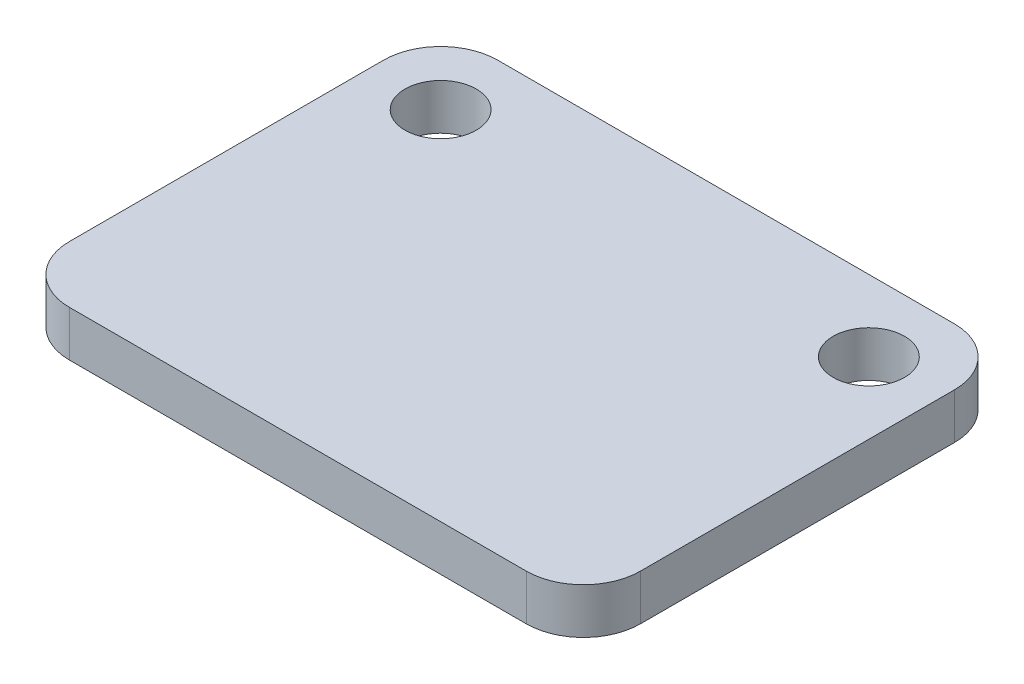
ISO-10303-21;
HEADER;
FILE_DESCRIPTION(('STEP AP214'),'2;1');
FILE_NAME('part.step','',(''),(''),'','','');
FILE_SCHEMA(('AUTOMOTIVE_DESIGN { 1 0 10303 214 1 1 1 1 }'));
ENDSEC;
DATA;
#1=APPLICATION_CONTEXT('core data for automotive mechanical design processes');
#2=APPLICATION_PROTOCOL_DEFINITION('international standard','automotive_design',2000,#1);
#3=PRODUCT_CONTEXT('',#1,'mechanical');
#4=PRODUCT('Part','Part','',(#3));
#5=PRODUCT_RELATED_PRODUCT_CATEGORY('part','',(#4));
#6=PRODUCT_DEFINITION_FORMATION('','',#4);
#7=PRODUCT_DEFINITION_CONTEXT('part definition',#1,'design');
#8=PRODUCT_DEFINITION('design','',#6,#7);
#9=PRODUCT_DEFINITION_SHAPE('','',#8);
#10=(LENGTH_UNIT() NAMED_UNIT(*) SI_UNIT(.MILLI.,.METRE.));
#11=(NAMED_UNIT(*) PLANE_ANGLE_UNIT() SI_UNIT($,.RADIAN.));
#12=(NAMED_UNIT(*) SI_UNIT($,.STERADIAN.) SOLID_ANGLE_UNIT());
#13=UNCERTAINTY_MEASURE_WITH_UNIT(LENGTH_MEASURE(1.E-05),#10,'distance_accuracy_value','');
#14=(GEOMETRIC_REPRESENTATION_CONTEXT(3) GLOBAL_UNCERTAINTY_ASSIGNED_CONTEXT((#13)) GLOBAL_UNIT_ASSIGNED_CONTEXT((#10,
#11,#12)) REPRESENTATION_CONTEXT('',''));
#15=CARTESIAN_POINT('',(0.,0.,0.));
#16=DIRECTION('',(0.,0.,1.));
#17=DIRECTION('',(1.,0.,0.));
#18=AXIS2_PLACEMENT_3D('',#15,#16,#17);
#19=CARTESIAN_POINT('',(0.,1.6,0.));
#20=DIRECTION('',(0.,1.,0.));
#21=DIRECTION('',(0.,0.,1.));
#22=AXIS2_PLACEMENT_3D('',#19,#20,#21);
#23=PLANE('',#22);
#24=CARTESIAN_POINT('',(-7.5,1.6,-5.));
#25=DIRECTION('',(0.,1.,0.));
#26=DIRECTION('',(0.,0.,1.));
#27=AXIS2_PLACEMENT_3D('',#24,#25,#26);
#28=CIRCLE('',#27,1.25);
#29=CARTESIAN_POINT('',(-7.5,1.6,-3.75));
#30=VERTEX_POINT('',#29);
#31=EDGE_CURVE('E208',#30,#30,#28,.T.);
#32=ORIENTED_EDGE('',*,*,#31,.F.);
#33=EDGE_LOOP('',(#32));
#34=FACE_BOUND('',#33,.T.);
#35=DIRECTION('',(-1.,0.,0.));
#36=VECTOR('',#35,1.);
#37=CARTESIAN_POINT('',(-10.,1.6,-7.5));
#38=LINE('',#37,#36);
#39=CARTESIAN_POINT('',(8.,1.6,-7.5));
#40=VERTEX_POINT('',#39);
#41=CARTESIAN_POINT('',(-8.,1.6,-7.5));
#42=VERTEX_POINT('',#41);
#43=EDGE_CURVE('E195',#40,#42,#38,.T.);
#44=ORIENTED_EDGE('',*,*,#43,.T.);
#45=CARTESIAN_POINT('',(-8.,1.6,-5.5));
#46=DIRECTION('',(0.,1.,0.));
#47=DIRECTION('',(0.,0.,1.));
#48=AXIS2_PLACEMENT_3D('',#45,#46,#47);
#49=CIRCLE('',#48,2.);
#50=CARTESIAN_POINT('',(-10.,1.6,-5.5));
#51=VERTEX_POINT('',#50);
#52=EDGE_CURVE('E168',#42,#51,#49,.T.);
#53=ORIENTED_EDGE('',*,*,#52,.T.);
#54=DIRECTION('',(0.,0.,1.));
#55=VECTOR('',#54,1.);
#56=CARTESIAN_POINT('',(-10.,1.6,-7.5));
#57=LINE('',#56,#55);
#58=CARTESIAN_POINT('',(-10.,1.6,5.5));
#59=VERTEX_POINT('',#58);
#60=EDGE_CURVE('E125',#51,#59,#57,.T.);
#61=ORIENTED_EDGE('',*,*,#60,.T.);
#62=CARTESIAN_POINT('',(-8.,1.6,5.5));
#63=DIRECTION('',(0.,1.,0.));
#64=DIRECTION('',(0.,0.,1.));
#65=AXIS2_PLACEMENT_3D('',#62,#63,#64);
#66=CIRCLE('',#65,2.);
#67=CARTESIAN_POINT('',(-8.,1.6,7.5));
#68=VERTEX_POINT('',#67);
#69=EDGE_CURVE('E60',#59,#68,#66,.T.);
#70=ORIENTED_EDGE('',*,*,#69,.T.);
#71=DIRECTION('',(1.,0.,0.));
#72=VECTOR('',#71,1.);
#73=CARTESIAN_POINT('',(-10.,1.6,7.5));
#74=LINE('',#73,#72);
#75=CARTESIAN_POINT('',(8.,1.6,7.5));
#76=VERTEX_POINT('',#75);
#77=EDGE_CURVE('E146',#68,#76,#74,.T.);
#78=ORIENTED_EDGE('',*,*,#77,.T.);
#79=CARTESIAN_POINT('',(8.,1.6,5.5));
#80=DIRECTION('',(0.,1.,0.));
#81=DIRECTION('',(0.,0.,1.));
#82=AXIS2_PLACEMENT_3D('',#79,#80,#81);
#83=CIRCLE('',#82,2.);
#84=CARTESIAN_POINT('',(10.,1.6,5.5));
#85=VERTEX_POINT('',#84);
#86=EDGE_CURVE('E162',#76,#85,#83,.T.);
#87=ORIENTED_EDGE('',*,*,#86,.T.);
#88=DIRECTION('',(0.,0.,-1.));
#89=VECTOR('',#88,1.);
#90=CARTESIAN_POINT('',(10.,1.6,-7.5));
#91=LINE('',#90,#89);
#92=CARTESIAN_POINT('',(10.,1.6,-5.5));
#93=VERTEX_POINT('',#92);
#94=EDGE_CURVE('E139',#85,#93,#91,.T.);
#95=ORIENTED_EDGE('',*,*,#94,.T.);
#96=CARTESIAN_POINT('',(8.,1.6,-5.5));
#97=DIRECTION('',(0.,1.,0.));
#98=DIRECTION('',(0.,0.,1.));
#99=AXIS2_PLACEMENT_3D('',#96,#97,#98);
#100=CIRCLE('',#99,2.);
#101=EDGE_CURVE('E165',#93,#40,#100,.T.);
#102=ORIENTED_EDGE('',*,*,#101,.T.);
#103=EDGE_LOOP('',(#44,#53,#61,#70,#78,#87,#95,#102));
#104=FACE_BOUND('',#103,.T.);
#105=CARTESIAN_POINT('',(7.5,1.6,-5.));
#106=DIRECTION('',(0.,1.,0.));
#107=DIRECTION('',(0.,0.,1.));
#108=AXIS2_PLACEMENT_3D('',#105,#106,#107);
#109=CIRCLE('',#108,1.25);
#110=CARTESIAN_POINT('',(7.5,1.6,-3.75));
#111=VERTEX_POINT('',#110);
#112=EDGE_CURVE('E215',#111,#111,#109,.T.);
#113=ORIENTED_EDGE('',*,*,#112,.F.);
#114=EDGE_LOOP('',(#113));
#115=FACE_BOUND('',#114,.T.);
#116=ADVANCED_FACE('F39',(#34,#104,#115),#23,.T.);
#117=CARTESIAN_POINT('',(0.,0.,0.));
#118=DIRECTION('',(0.,1.,0.));
#119=DIRECTION('',(0.,0.,1.));
#120=AXIS2_PLACEMENT_3D('',#117,#118,#119);
#121=PLANE('',#120);
#122=DIRECTION('',(0.,0.,1.));
#123=VECTOR('',#122,1.);
#124=CARTESIAN_POINT('',(-10.,0.,-7.5));
#125=LINE('',#124,#123);
#126=CARTESIAN_POINT('',(-10.,0.,-5.5));
#127=VERTEX_POINT('',#126);
#128=CARTESIAN_POINT('',(-10.,0.,5.5));
#129=VERTEX_POINT('',#128);
#130=EDGE_CURVE('E123',#127,#129,#125,.T.);
#131=ORIENTED_EDGE('',*,*,#130,.F.);
#132=CARTESIAN_POINT('',(-8.,0.,-5.5));
#133=DIRECTION('',(0.,1.,0.));
#134=DIRECTION('',(0.,0.,1.));
#135=AXIS2_PLACEMENT_3D('',#132,#133,#134);
#136=CIRCLE('',#135,2.);
#137=CARTESIAN_POINT('',(-8.,0.,-7.5));
#138=VERTEX_POINT('',#137);
#139=EDGE_CURVE('E105',#127,#138,#136,.F.);
#140=ORIENTED_EDGE('',*,*,#139,.T.);
#141=DIRECTION('',(-1.,0.,0.));
#142=VECTOR('',#141,1.);
#143=CARTESIAN_POINT('',(-10.,0.,-7.5));
#144=LINE('',#143,#142);
#145=CARTESIAN_POINT('',(8.,0.,-7.5));
#146=VERTEX_POINT('',#145);
#147=EDGE_CURVE('E135',#146,#138,#144,.T.);
#148=ORIENTED_EDGE('',*,*,#147,.F.);
#149=CARTESIAN_POINT('',(8.,0.,-5.5));
#150=DIRECTION('',(0.,1.,0.));
#151=DIRECTION('',(0.,0.,1.));
#152=AXIS2_PLACEMENT_3D('',#149,#150,#151);
#153=CIRCLE('',#152,2.);
#154=CARTESIAN_POINT('',(10.,0.,-5.5));
#155=VERTEX_POINT('',#154);
#156=EDGE_CURVE('E117',#146,#155,#153,.F.);
#157=ORIENTED_EDGE('',*,*,#156,.T.);
#158=DIRECTION('',(0.,0.,-1.));
#159=VECTOR('',#158,1.);
#160=CARTESIAN_POINT('',(10.,0.,-7.5));
#161=LINE('',#160,#159);
#162=CARTESIAN_POINT('',(10.,0.,5.5));
#163=VERTEX_POINT('',#162);
#164=EDGE_CURVE('E141',#163,#155,#161,.T.);
#165=ORIENTED_EDGE('',*,*,#164,.F.);
#166=CARTESIAN_POINT('',(8.,0.,5.5));
#167=DIRECTION('',(0.,1.,0.));
#168=DIRECTION('',(0.,0.,1.));
#169=AXIS2_PLACEMENT_3D('',#166,#167,#168);
#170=CIRCLE('',#169,2.);
#171=CARTESIAN_POINT('',(8.,0.,7.5));
#172=VERTEX_POINT('',#171);
#173=EDGE_CURVE('E150',#163,#172,#170,.F.);
#174=ORIENTED_EDGE('',*,*,#173,.T.);
#175=DIRECTION('',(1.,0.,0.));
#176=VECTOR('',#175,1.);
#177=CARTESIAN_POINT('',(-10.,0.,7.5));
#178=LINE('',#177,#176);
#179=CARTESIAN_POINT('',(-8.,0.,7.5));
#180=VERTEX_POINT('',#179);
#181=EDGE_CURVE('E134',#180,#172,#178,.T.);
#182=ORIENTED_EDGE('',*,*,#181,.F.);
#183=CARTESIAN_POINT('',(-8.,0.,5.5));
#184=DIRECTION('',(0.,1.,0.));
#185=DIRECTION('',(0.,0.,1.));
#186=AXIS2_PLACEMENT_3D('',#183,#184,#185);
#187=CIRCLE('',#186,2.);
#188=EDGE_CURVE('E127',#180,#129,#187,.F.);
#189=ORIENTED_EDGE('',*,*,#188,.T.);
#190=EDGE_LOOP('',(#131,#140,#148,#157,#165,#174,#182,#189));
#191=FACE_BOUND('',#190,.T.);
#192=CARTESIAN_POINT('',(-7.5,0.,-5.));
#193=DIRECTION('',(0.,1.,0.));
#194=DIRECTION('',(0.,0.,1.));
#195=AXIS2_PLACEMENT_3D('',#192,#193,#194);
#196=CIRCLE('',#195,1.25);
#197=CARTESIAN_POINT('',(-7.5,0.,-3.75));
#198=VERTEX_POINT('',#197);
#199=EDGE_CURVE('E201',#198,#198,#196,.T.);
#200=ORIENTED_EDGE('',*,*,#199,.T.);
#201=EDGE_LOOP('',(#200));
#202=FACE_BOUND('',#201,.T.);
#203=CARTESIAN_POINT('',(7.5,0.,-5.));
#204=DIRECTION('',(0.,1.,0.));
#205=DIRECTION('',(0.,0.,1.));
#206=AXIS2_PLACEMENT_3D('',#203,#204,#205);
#207=CIRCLE('',#206,1.25);
#208=CARTESIAN_POINT('',(7.5,0.,-3.75));
#209=VERTEX_POINT('',#208);
#210=EDGE_CURVE('E217',#209,#209,#207,.T.);
#211=ORIENTED_EDGE('',*,*,#210,.T.);
#212=EDGE_LOOP('',(#211));
#213=FACE_BOUND('',#212,.T.);
#214=ADVANCED_FACE('F130',(#191,#202,#213),#121,.F.);
#215=CARTESIAN_POINT('',(10.,1.6,-7.5));
#216=DIRECTION('',(-1.,0.,0.));
#217=DIRECTION('',(0.,0.,1.));
#218=AXIS2_PLACEMENT_3D('',#215,#216,#217);
#219=PLANE('',#218);
#220=ORIENTED_EDGE('',*,*,#164,.T.);
#221=DIRECTION('',(0.,-1.,0.));
#222=VECTOR('',#221,1.);
#223=CARTESIAN_POINT('',(10.,1.6,-5.5));
#224=LINE('',#223,#222);
#225=EDGE_CURVE('E175',#155,#93,#224,.F.);
#226=ORIENTED_EDGE('',*,*,#225,.T.);
#227=ORIENTED_EDGE('',*,*,#94,.F.);
#228=DIRECTION('',(0.,-1.,0.));
#229=VECTOR('',#228,1.);
#230=CARTESIAN_POINT('',(10.,1.6,5.5));
#231=LINE('',#230,#229);
#232=EDGE_CURVE('E171',#85,#163,#231,.T.);
#233=ORIENTED_EDGE('',*,*,#232,.T.);
#234=EDGE_LOOP('',(#220,#226,#227,#233));
#235=FACE_BOUND('',#234,.T.);
#236=ADVANCED_FACE('F190',(#235),#219,.F.);
#237=CARTESIAN_POINT('',(-10.,1.6,-7.5));
#238=DIRECTION('',(0.,0.,1.));
#239=DIRECTION('',(1.,0.,0.));
#240=AXIS2_PLACEMENT_3D('',#237,#238,#239);
#241=PLANE('',#240);
#242=ORIENTED_EDGE('',*,*,#147,.T.);
#243=DIRECTION('',(0.,-1.,0.));
#244=VECTOR('',#243,1.);
#245=CARTESIAN_POINT('',(-8.,1.6,-7.5));
#246=LINE('',#245,#244);
#247=EDGE_CURVE('E110',#138,#42,#246,.F.);
#248=ORIENTED_EDGE('',*,*,#247,.T.);
#249=ORIENTED_EDGE('',*,*,#43,.F.);
#250=DIRECTION('',(0.,-1.,0.));
#251=VECTOR('',#250,1.);
#252=CARTESIAN_POINT('',(8.,1.6,-7.5));
#253=LINE('',#252,#251);
#254=EDGE_CURVE('E116',#40,#146,#253,.T.);
#255=ORIENTED_EDGE('',*,*,#254,.T.);
#256=EDGE_LOOP('',(#242,#248,#249,#255));
#257=FACE_BOUND('',#256,.T.);
#258=ADVANCED_FACE('F243',(#257),#241,.F.);
#259=CARTESIAN_POINT('',(-10.,1.6,-7.5));
#260=DIRECTION('',(1.,0.,0.));
#261=DIRECTION('',(0.,0.,-1.));
#262=AXIS2_PLACEMENT_3D('',#259,#260,#261);
#263=PLANE('',#262);
#264=ORIENTED_EDGE('',*,*,#60,.F.);
#265=DIRECTION('',(0.,-1.,0.));
#266=VECTOR('',#265,1.);
#267=CARTESIAN_POINT('',(-10.,1.6,-5.5));
#268=LINE('',#267,#266);
#269=EDGE_CURVE('E109',#51,#127,#268,.T.);
#270=ORIENTED_EDGE('',*,*,#269,.T.);
#271=ORIENTED_EDGE('',*,*,#130,.T.);
#272=DIRECTION('',(0.,-1.,0.));
#273=VECTOR('',#272,1.);
#274=CARTESIAN_POINT('',(-10.,1.6,5.5));
#275=LINE('',#274,#273);
#276=EDGE_CURVE('E128',#129,#59,#275,.F.);
#277=ORIENTED_EDGE('',*,*,#276,.T.);
#278=EDGE_LOOP('',(#264,#270,#271,#277));
#279=FACE_BOUND('',#278,.T.);
#280=ADVANCED_FACE('F122',(#279),#263,.F.);
#281=CARTESIAN_POINT('',(-10.,1.6,7.5));
#282=DIRECTION('',(0.,0.,-1.));
#283=DIRECTION('',(-1.,0.,0.));
#284=AXIS2_PLACEMENT_3D('',#281,#282,#283);
#285=PLANE('',#284);
#286=ORIENTED_EDGE('',*,*,#181,.T.);
#287=DIRECTION('',(0.,-1.,0.));
#288=VECTOR('',#287,1.);
#289=CARTESIAN_POINT('',(8.,1.6,7.5));
#290=LINE('',#289,#288);
#291=EDGE_CURVE('E11',#172,#76,#290,.F.);
#292=ORIENTED_EDGE('',*,*,#291,.T.);
#293=ORIENTED_EDGE('',*,*,#77,.F.);
#294=DIRECTION('',(0.,-1.,0.));
#295=VECTOR('',#294,1.);
#296=CARTESIAN_POINT('',(-8.,1.6,7.5));
#297=LINE('',#296,#295);
#298=EDGE_CURVE('E48',#68,#180,#297,.T.);
#299=ORIENTED_EDGE('',*,*,#298,.T.);
#300=EDGE_LOOP('',(#286,#292,#293,#299));
#301=FACE_BOUND('',#300,.T.);
#302=ADVANCED_FACE('F180',(#301),#285,.F.);
#303=CARTESIAN_POINT('',(-7.5,1.6,-5.));
#304=DIRECTION('',(0.,-1.,0.));
#305=DIRECTION('',(0.,0.,-1.));
#306=AXIS2_PLACEMENT_3D('',#303,#304,#305);
#307=CYLINDRICAL_SURFACE('',#306,1.25);
#308=ORIENTED_EDGE('',*,*,#31,.T.);
#309=EDGE_LOOP('',(#308));
#310=FACE_BOUND('',#309,.T.);
#311=ORIENTED_EDGE('',*,*,#199,.F.);
#312=EDGE_LOOP('',(#311));
#313=FACE_BOUND('',#312,.T.);
#314=ADVANCED_FACE('F236',(#310,#313),#307,.F.);
#315=CARTESIAN_POINT('',(7.5,1.6,-5.));
#316=DIRECTION('',(0.,-1.,0.));
#317=DIRECTION('',(0.,0.,-1.));
#318=AXIS2_PLACEMENT_3D('',#315,#316,#317);
#319=CYLINDRICAL_SURFACE('',#318,1.25);
#320=ORIENTED_EDGE('',*,*,#112,.T.);
#321=EDGE_LOOP('',(#320));
#322=FACE_BOUND('',#321,.T.);
#323=ORIENTED_EDGE('',*,*,#210,.F.);
#324=EDGE_LOOP('',(#323));
#325=FACE_BOUND('',#324,.T.);
#326=ADVANCED_FACE('F225',(#322,#325),#319,.F.);
#327=CARTESIAN_POINT('',(-8.,1.6,-5.5));
#328=DIRECTION('',(0.,-1.,0.));
#329=DIRECTION('',(0.,0.,-1.));
#330=AXIS2_PLACEMENT_3D('',#327,#328,#329);
#331=CYLINDRICAL_SURFACE('',#330,2.);
#332=ORIENTED_EDGE('',*,*,#52,.F.);
#333=ORIENTED_EDGE('',*,*,#247,.F.);
#334=ORIENTED_EDGE('',*,*,#139,.F.);
#335=ORIENTED_EDGE('',*,*,#269,.F.);
#336=EDGE_LOOP('',(#332,#333,#334,#335));
#337=FACE_BOUND('',#336,.T.);
#338=ADVANCED_FACE('F108',(#337),#331,.T.);
#339=CARTESIAN_POINT('',(8.,1.6,-5.5));
#340=DIRECTION('',(0.,-1.,0.));
#341=DIRECTION('',(0.,0.,-1.));
#342=AXIS2_PLACEMENT_3D('',#339,#340,#341);
#343=CYLINDRICAL_SURFACE('',#342,2.);
#344=ORIENTED_EDGE('',*,*,#101,.F.);
#345=ORIENTED_EDGE('',*,*,#225,.F.);
#346=ORIENTED_EDGE('',*,*,#156,.F.);
#347=ORIENTED_EDGE('',*,*,#254,.F.);
#348=EDGE_LOOP('',(#344,#345,#346,#347));
#349=FACE_BOUND('',#348,.T.);
#350=ADVANCED_FACE('F251',(#349),#343,.T.);
#351=CARTESIAN_POINT('',(8.,1.6,5.5));
#352=DIRECTION('',(0.,-1.,0.));
#353=DIRECTION('',(0.,0.,-1.));
#354=AXIS2_PLACEMENT_3D('',#351,#352,#353);
#355=CYLINDRICAL_SURFACE('',#354,2.);
#356=ORIENTED_EDGE('',*,*,#86,.F.);
#357=ORIENTED_EDGE('',*,*,#291,.F.);
#358=ORIENTED_EDGE('',*,*,#173,.F.);
#359=ORIENTED_EDGE('',*,*,#232,.F.);
#360=EDGE_LOOP('',(#356,#357,#358,#359));
#361=FACE_BOUND('',#360,.T.);
#362=ADVANCED_FACE('F187',(#361),#355,.T.);
#363=CARTESIAN_POINT('',(-8.,1.6,5.5));
#364=DIRECTION('',(0.,-1.,0.));
#365=DIRECTION('',(0.,0.,-1.));
#366=AXIS2_PLACEMENT_3D('',#363,#364,#365);
#367=CYLINDRICAL_SURFACE('',#366,2.);
#368=ORIENTED_EDGE('',*,*,#69,.F.);
#369=ORIENTED_EDGE('',*,*,#276,.F.);
#370=ORIENTED_EDGE('',*,*,#188,.F.);
#371=ORIENTED_EDGE('',*,*,#298,.F.);
#372=EDGE_LOOP('',(#368,#369,#370,#371));
#373=FACE_BOUND('',#372,.T.);
#374=ADVANCED_FACE('F41',(#373),#367,.T.);
#375=CLOSED_SHELL('',(#116,#214,#236,#258,#280,#302,#314,#326,#338,#350,#362,#374));
#376=MANIFOLD_SOLID_BREP('B2',#375);
#377=ADVANCED_BREP_SHAPE_REPRESENTATION('',(#18,#376),#14);
#378=SHAPE_DEFINITION_REPRESENTATION(#9,#377);
ENDSEC;
END-ISO-10303-21;
